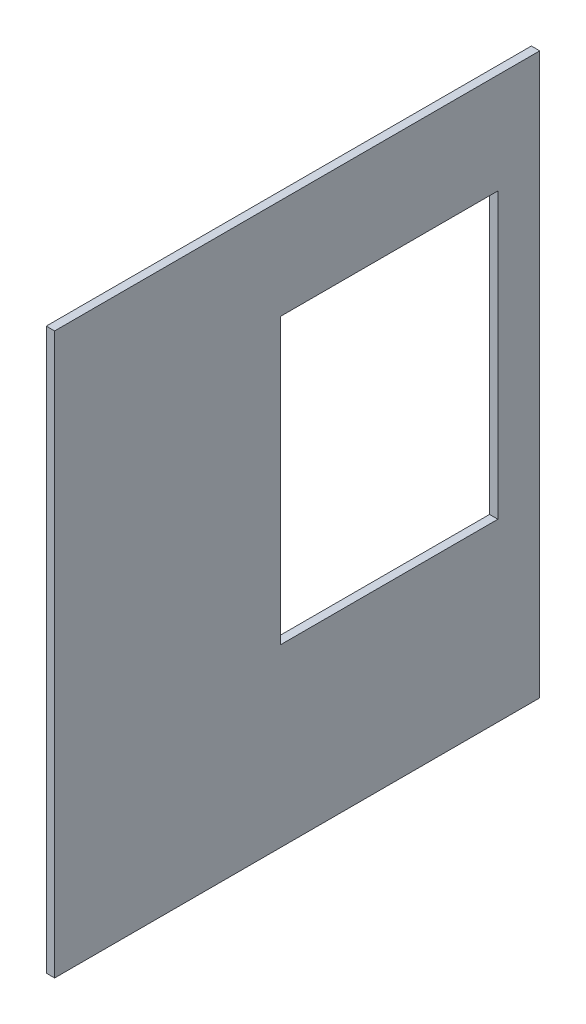
ISO-10303-21;
HEADER;
FILE_DESCRIPTION(('STEP AP214'),'2;1');
FILE_NAME('part.step','',(''),(''),'','','');
FILE_SCHEMA(('AUTOMOTIVE_DESIGN { 1 0 10303 214 1 1 1 1 }'));
ENDSEC;
DATA;
#1=APPLICATION_CONTEXT('core data for automotive mechanical design processes');
#2=APPLICATION_PROTOCOL_DEFINITION('international standard','automotive_design',2000,#1);
#3=PRODUCT_CONTEXT('',#1,'mechanical');
#4=PRODUCT('Part','Part','',(#3));
#5=PRODUCT_RELATED_PRODUCT_CATEGORY('part','',(#4));
#6=PRODUCT_DEFINITION_FORMATION('','',#4);
#7=PRODUCT_DEFINITION_CONTEXT('part definition',#1,'design');
#8=PRODUCT_DEFINITION('design','',#6,#7);
#9=PRODUCT_DEFINITION_SHAPE('','',#8);
#10=(LENGTH_UNIT() NAMED_UNIT(*) SI_UNIT(.MILLI.,.METRE.));
#11=(NAMED_UNIT(*) PLANE_ANGLE_UNIT() SI_UNIT($,.RADIAN.));
#12=(NAMED_UNIT(*) SI_UNIT($,.STERADIAN.) SOLID_ANGLE_UNIT());
#13=UNCERTAINTY_MEASURE_WITH_UNIT(LENGTH_MEASURE(1.E-05),#10,'distance_accuracy_value','');
#14=(GEOMETRIC_REPRESENTATION_CONTEXT(3) GLOBAL_UNCERTAINTY_ASSIGNED_CONTEXT((#13)) GLOBAL_UNIT_ASSIGNED_CONTEXT((#10,
#11,#12)) REPRESENTATION_CONTEXT('',''));
#15=CARTESIAN_POINT('',(0.,0.,0.));
#16=DIRECTION('',(0.,0.,1.));
#17=DIRECTION('',(1.,0.,0.));
#18=AXIS2_PLACEMENT_3D('',#15,#16,#17);
#19=CARTESIAN_POINT('',(10.,0.,0.));
#20=DIRECTION('',(1.,0.,0.));
#21=DIRECTION('',(0.,0.,-1.));
#22=AXIS2_PLACEMENT_3D('',#19,#20,#21);
#23=PLANE('',#22);
#24=DIRECTION('',(0.,-1.,0.));
#25=VECTOR('',#24,1.);
#26=CARTESIAN_POINT('',(10.,39.7217441792276,64.5910281671344));
#27=LINE('',#26,#25);
#28=CARTESIAN_POINT('',(10.,39.7217441792276,64.5910281671344));
#29=VERTEX_POINT('',#28);
#30=CARTESIAN_POINT('',(10.,-630.278255820772,64.5910281671343));
#31=VERTEX_POINT('',#30);
#32=EDGE_CURVE('E133',#29,#31,#27,.T.);
#33=ORIENTED_EDGE('',*,*,#32,.T.);
#34=DIRECTION('',(0.,0.,-1.));
#35=VECTOR('',#34,1.);
#36=CARTESIAN_POINT('',(10.,-630.278255820772,64.5910281671343));
#37=LINE('',#36,#35);
#38=CARTESIAN_POINT('',(10.,-630.278255820772,-515.408971832866));
#39=VERTEX_POINT('',#38);
#40=EDGE_CURVE('E136',#31,#39,#37,.T.);
#41=ORIENTED_EDGE('',*,*,#40,.T.);
#42=DIRECTION('',(0.,1.,0.));
#43=VECTOR('',#42,1.);
#44=CARTESIAN_POINT('',(10.,39.7217441792276,-515.408971832866));
#45=LINE('',#44,#43);
#46=CARTESIAN_POINT('',(10.,39.7217441792276,-515.408971832866));
#47=VERTEX_POINT('',#46);
#48=EDGE_CURVE('E139',#39,#47,#45,.T.);
#49=ORIENTED_EDGE('',*,*,#48,.T.);
#50=DIRECTION('',(0.,0.,1.));
#51=VECTOR('',#50,1.);
#52=CARTESIAN_POINT('',(10.,39.7217441792276,64.5910281671344));
#53=LINE('',#52,#51);
#54=EDGE_CURVE('E141',#47,#29,#53,.T.);
#55=ORIENTED_EDGE('',*,*,#54,.T.);
#56=EDGE_LOOP('',(#33,#41,#49,#55));
#57=FACE_BOUND('',#56,.T.);
#58=DIRECTION('',(0.,0.,1.));
#59=VECTOR('',#58,1.);
#60=CARTESIAN_POINT('',(10.,-80.2782558207725,-465.408971832866));
#61=LINE('',#60,#59);
#62=CARTESIAN_POINT('',(10.,-80.2782558207725,-465.408971832866));
#63=VERTEX_POINT('',#62);
#64=CARTESIAN_POINT('',(10.,-80.2782558207725,-205.408971832866));
#65=VERTEX_POINT('',#64);
#66=EDGE_CURVE('E105',#63,#65,#61,.T.);
#67=ORIENTED_EDGE('',*,*,#66,.F.);
#68=DIRECTION('',(0.,1.,0.));
#69=VECTOR('',#68,1.);
#70=CARTESIAN_POINT('',(10.,-80.2782558207725,-465.408971832866));
#71=LINE('',#70,#69);
#72=CARTESIAN_POINT('',(10.,-420.278255820772,-465.408971832866));
#73=VERTEX_POINT('',#72);
#74=EDGE_CURVE('E97',#73,#63,#71,.T.);
#75=ORIENTED_EDGE('',*,*,#74,.F.);
#76=DIRECTION('',(0.,0.,-1.));
#77=VECTOR('',#76,1.);
#78=CARTESIAN_POINT('',(10.,-420.278255820772,-465.408971832866));
#79=LINE('',#78,#77);
#80=CARTESIAN_POINT('',(10.,-420.278255820773,-205.408971832866));
#81=VERTEX_POINT('',#80);
#82=EDGE_CURVE('E119',#81,#73,#79,.T.);
#83=ORIENTED_EDGE('',*,*,#82,.F.);
#84=DIRECTION('',(0.,-1.,0.));
#85=VECTOR('',#84,1.);
#86=CARTESIAN_POINT('',(10.,-80.2782558207725,-205.408971832866));
#87=LINE('',#86,#85);
#88=EDGE_CURVE('E117',#65,#81,#87,.T.);
#89=ORIENTED_EDGE('',*,*,#88,.F.);
#90=EDGE_LOOP('',(#67,#75,#83,#89));
#91=FACE_BOUND('',#90,.T.);
#92=ADVANCED_FACE('F32',(#57,#91),#23,.T.);
#93=CARTESIAN_POINT('',(0.,0.,0.));
#94=DIRECTION('',(1.,0.,0.));
#95=DIRECTION('',(0.,0.,-1.));
#96=AXIS2_PLACEMENT_3D('',#93,#94,#95);
#97=PLANE('',#96);
#98=DIRECTION('',(0.,-1.,0.));
#99=VECTOR('',#98,1.);
#100=CARTESIAN_POINT('',(0.,39.7217441792276,64.5910281671344));
#101=LINE('',#100,#99);
#102=CARTESIAN_POINT('',(0.,39.7217441792276,64.5910281671344));
#103=VERTEX_POINT('',#102);
#104=CARTESIAN_POINT('',(0.,-630.278255820772,64.5910281671343));
#105=VERTEX_POINT('',#104);
#106=EDGE_CURVE('E113',#103,#105,#101,.T.);
#107=ORIENTED_EDGE('',*,*,#106,.F.);
#108=DIRECTION('',(0.,0.,1.));
#109=VECTOR('',#108,1.);
#110=CARTESIAN_POINT('',(0.,39.7217441792276,64.5910281671344));
#111=LINE('',#110,#109);
#112=CARTESIAN_POINT('',(0.,39.7217441792276,-515.408971832866));
#113=VERTEX_POINT('',#112);
#114=EDGE_CURVE('E137',#113,#103,#111,.T.);
#115=ORIENTED_EDGE('',*,*,#114,.F.);
#116=DIRECTION('',(0.,1.,0.));
#117=VECTOR('',#116,1.);
#118=CARTESIAN_POINT('',(0.,39.7217441792276,-515.408971832866));
#119=LINE('',#118,#117);
#120=CARTESIAN_POINT('',(0.,-630.278255820772,-515.408971832866));
#121=VERTEX_POINT('',#120);
#122=EDGE_CURVE('E148',#121,#113,#119,.T.);
#123=ORIENTED_EDGE('',*,*,#122,.F.);
#124=DIRECTION('',(0.,0.,-1.));
#125=VECTOR('',#124,1.);
#126=CARTESIAN_POINT('',(0.,-630.278255820772,64.5910281671343));
#127=LINE('',#126,#125);
#128=EDGE_CURVE('E146',#105,#121,#127,.T.);
#129=ORIENTED_EDGE('',*,*,#128,.F.);
#130=EDGE_LOOP('',(#107,#115,#123,#129));
#131=FACE_BOUND('',#130,.T.);
#132=DIRECTION('',(0.,1.,0.));
#133=VECTOR('',#132,1.);
#134=CARTESIAN_POINT('',(0.,-80.2782558207725,-465.408971832866));
#135=LINE('',#134,#133);
#136=CARTESIAN_POINT('',(0.,-420.278255820772,-465.408971832866));
#137=VERTEX_POINT('',#136);
#138=CARTESIAN_POINT('',(0.,-80.2782558207725,-465.408971832866));
#139=VERTEX_POINT('',#138);
#140=EDGE_CURVE('E55',#137,#139,#135,.T.);
#141=ORIENTED_EDGE('',*,*,#140,.T.);
#142=DIRECTION('',(0.,0.,1.));
#143=VECTOR('',#142,1.);
#144=CARTESIAN_POINT('',(0.,-80.2782558207725,-465.408971832866));
#145=LINE('',#144,#143);
#146=CARTESIAN_POINT('',(0.,-80.2782558207725,-205.408971832866));
#147=VERTEX_POINT('',#146);
#148=EDGE_CURVE('E112',#139,#147,#145,.T.);
#149=ORIENTED_EDGE('',*,*,#148,.T.);
#150=DIRECTION('',(0.,-1.,0.));
#151=VECTOR('',#150,1.);
#152=CARTESIAN_POINT('',(0.,-80.2782558207725,-205.408971832866));
#153=LINE('',#152,#151);
#154=CARTESIAN_POINT('',(0.,-420.278255820773,-205.408971832866));
#155=VERTEX_POINT('',#154);
#156=EDGE_CURVE('E125',#147,#155,#153,.T.);
#157=ORIENTED_EDGE('',*,*,#156,.T.);
#158=DIRECTION('',(0.,0.,-1.));
#159=VECTOR('',#158,1.);
#160=CARTESIAN_POINT('',(0.,-420.278255820772,-465.408971832866));
#161=LINE('',#160,#159);
#162=EDGE_CURVE('E106',#155,#137,#161,.T.);
#163=ORIENTED_EDGE('',*,*,#162,.T.);
#164=EDGE_LOOP('',(#141,#149,#157,#163));
#165=FACE_BOUND('',#164,.T.);
#166=ADVANCED_FACE('F166',(#131,#165),#97,.F.);
#167=CARTESIAN_POINT('',(10.,39.7217441792276,64.5910281671344));
#168=DIRECTION('',(0.,0.,-1.));
#169=DIRECTION('',(0.,1.,0.));
#170=AXIS2_PLACEMENT_3D('',#167,#168,#169);
#171=PLANE('',#170);
#172=ORIENTED_EDGE('',*,*,#106,.T.);
#173=DIRECTION('',(-1.,0.,0.));
#174=VECTOR('',#173,1.);
#175=CARTESIAN_POINT('',(10.,-630.278255820772,64.5910281671343));
#176=LINE('',#175,#174);
#177=EDGE_CURVE('E11',#31,#105,#176,.T.);
#178=ORIENTED_EDGE('',*,*,#177,.F.);
#179=ORIENTED_EDGE('',*,*,#32,.F.);
#180=DIRECTION('',(-1.,0.,0.));
#181=VECTOR('',#180,1.);
#182=CARTESIAN_POINT('',(10.,39.7217441792276,64.5910281671344));
#183=LINE('',#182,#181);
#184=EDGE_CURVE('E143',#29,#103,#183,.T.);
#185=ORIENTED_EDGE('',*,*,#184,.T.);
#186=EDGE_LOOP('',(#172,#178,#179,#185));
#187=FACE_BOUND('',#186,.T.);
#188=ADVANCED_FACE('F34',(#187),#171,.F.);
#189=CARTESIAN_POINT('',(10.,-630.278255820772,64.5910281671343));
#190=DIRECTION('',(0.,1.,0.));
#191=DIRECTION('',(0.,0.,1.));
#192=AXIS2_PLACEMENT_3D('',#189,#190,#191);
#193=PLANE('',#192);
#194=ORIENTED_EDGE('',*,*,#128,.T.);
#195=DIRECTION('',(-1.,0.,0.));
#196=VECTOR('',#195,1.);
#197=CARTESIAN_POINT('',(10.,-630.278255820772,-515.408971832866));
#198=LINE('',#197,#196);
#199=EDGE_CURVE('E40',#39,#121,#198,.T.);
#200=ORIENTED_EDGE('',*,*,#199,.F.);
#201=ORIENTED_EDGE('',*,*,#40,.F.);
#202=ORIENTED_EDGE('',*,*,#177,.T.);
#203=EDGE_LOOP('',(#194,#200,#201,#202));
#204=FACE_BOUND('',#203,.T.);
#205=ADVANCED_FACE('F176',(#204),#193,.F.);
#206=CARTESIAN_POINT('',(10.,39.7217441792276,-515.408971832866));
#207=DIRECTION('',(0.,0.,1.));
#208=DIRECTION('',(0.,-1.,0.));
#209=AXIS2_PLACEMENT_3D('',#206,#207,#208);
#210=PLANE('',#209);
#211=ORIENTED_EDGE('',*,*,#122,.T.);
#212=DIRECTION('',(-1.,0.,0.));
#213=VECTOR('',#212,1.);
#214=CARTESIAN_POINT('',(10.,39.7217441792276,-515.408971832866));
#215=LINE('',#214,#213);
#216=EDGE_CURVE('E153',#47,#113,#215,.T.);
#217=ORIENTED_EDGE('',*,*,#216,.F.);
#218=ORIENTED_EDGE('',*,*,#48,.F.);
#219=ORIENTED_EDGE('',*,*,#199,.T.);
#220=EDGE_LOOP('',(#211,#217,#218,#219));
#221=FACE_BOUND('',#220,.T.);
#222=ADVANCED_FACE('F160',(#221),#210,.F.);
#223=CARTESIAN_POINT('',(10.,39.7217441792276,64.5910281671344));
#224=DIRECTION('',(0.,-1.,0.));
#225=DIRECTION('',(0.,0.,-1.));
#226=AXIS2_PLACEMENT_3D('',#223,#224,#225);
#227=PLANE('',#226);
#228=ORIENTED_EDGE('',*,*,#114,.T.);
#229=ORIENTED_EDGE('',*,*,#184,.F.);
#230=ORIENTED_EDGE('',*,*,#54,.F.);
#231=ORIENTED_EDGE('',*,*,#216,.T.);
#232=EDGE_LOOP('',(#228,#229,#230,#231));
#233=FACE_BOUND('',#232,.T.);
#234=ADVANCED_FACE('F170',(#233),#227,.F.);
#235=CARTESIAN_POINT('',(10.,-80.2782558207725,-465.408971832866));
#236=DIRECTION('',(0.,0.,1.));
#237=DIRECTION('',(0.,-1.,0.));
#238=AXIS2_PLACEMENT_3D('',#235,#236,#237);
#239=PLANE('',#238);
#240=ORIENTED_EDGE('',*,*,#140,.F.);
#241=DIRECTION('',(-1.,0.,0.));
#242=VECTOR('',#241,1.);
#243=CARTESIAN_POINT('',(10.,-420.278255820772,-465.408971832866));
#244=LINE('',#243,#242);
#245=EDGE_CURVE('E101',#73,#137,#244,.T.);
#246=ORIENTED_EDGE('',*,*,#245,.F.);
#247=ORIENTED_EDGE('',*,*,#74,.T.);
#248=DIRECTION('',(-1.,0.,0.));
#249=VECTOR('',#248,1.);
#250=CARTESIAN_POINT('',(10.,-80.2782558207725,-465.408971832866));
#251=LINE('',#250,#249);
#252=EDGE_CURVE('E100',#63,#139,#251,.T.);
#253=ORIENTED_EDGE('',*,*,#252,.T.);
#254=EDGE_LOOP('',(#240,#246,#247,#253));
#255=FACE_BOUND('',#254,.T.);
#256=ADVANCED_FACE('F99',(#255),#239,.T.);
#257=CARTESIAN_POINT('',(10.,-80.2782558207725,-465.408971832866));
#258=DIRECTION('',(0.,-1.,0.));
#259=DIRECTION('',(0.,0.,-1.));
#260=AXIS2_PLACEMENT_3D('',#257,#258,#259);
#261=PLANE('',#260);
#262=ORIENTED_EDGE('',*,*,#148,.F.);
#263=ORIENTED_EDGE('',*,*,#252,.F.);
#264=ORIENTED_EDGE('',*,*,#66,.T.);
#265=DIRECTION('',(-1.,0.,0.));
#266=VECTOR('',#265,1.);
#267=CARTESIAN_POINT('',(10.,-80.2782558207725,-205.408971832866));
#268=LINE('',#267,#266);
#269=EDGE_CURVE('E114',#65,#147,#268,.T.);
#270=ORIENTED_EDGE('',*,*,#269,.T.);
#271=EDGE_LOOP('',(#262,#263,#264,#270));
#272=FACE_BOUND('',#271,.T.);
#273=ADVANCED_FACE('F109',(#272),#261,.T.);
#274=CARTESIAN_POINT('',(10.,-80.2782558207725,-205.408971832866));
#275=DIRECTION('',(0.,0.,-1.));
#276=DIRECTION('',(0.,1.,0.));
#277=AXIS2_PLACEMENT_3D('',#274,#275,#276);
#278=PLANE('',#277);
#279=ORIENTED_EDGE('',*,*,#156,.F.);
#280=ORIENTED_EDGE('',*,*,#269,.F.);
#281=ORIENTED_EDGE('',*,*,#88,.T.);
#282=DIRECTION('',(-1.,0.,0.));
#283=VECTOR('',#282,1.);
#284=CARTESIAN_POINT('',(10.,-420.278255820773,-205.408971832866));
#285=LINE('',#284,#283);
#286=EDGE_CURVE('E47',#81,#155,#285,.T.);
#287=ORIENTED_EDGE('',*,*,#286,.T.);
#288=EDGE_LOOP('',(#279,#280,#281,#287));
#289=FACE_BOUND('',#288,.T.);
#290=ADVANCED_FACE('F199',(#289),#278,.T.);
#291=CARTESIAN_POINT('',(10.,-420.278255820772,-465.408971832866));
#292=DIRECTION('',(0.,1.,0.));
#293=DIRECTION('',(0.,0.,1.));
#294=AXIS2_PLACEMENT_3D('',#291,#292,#293);
#295=PLANE('',#294);
#296=ORIENTED_EDGE('',*,*,#162,.F.);
#297=ORIENTED_EDGE('',*,*,#286,.F.);
#298=ORIENTED_EDGE('',*,*,#82,.T.);
#299=ORIENTED_EDGE('',*,*,#245,.T.);
#300=EDGE_LOOP('',(#296,#297,#298,#299));
#301=FACE_BOUND('',#300,.T.);
#302=ADVANCED_FACE('F203',(#301),#295,.T.);
#303=CLOSED_SHELL('',(#92,#166,#188,#205,#222,#234,#256,#273,#290,#302));
#304=MANIFOLD_SOLID_BREP('B2',#303);
#305=ADVANCED_BREP_SHAPE_REPRESENTATION('',(#18,#304),#14);
#306=SHAPE_DEFINITION_REPRESENTATION(#9,#305);
ENDSEC;
END-ISO-10303-21;
